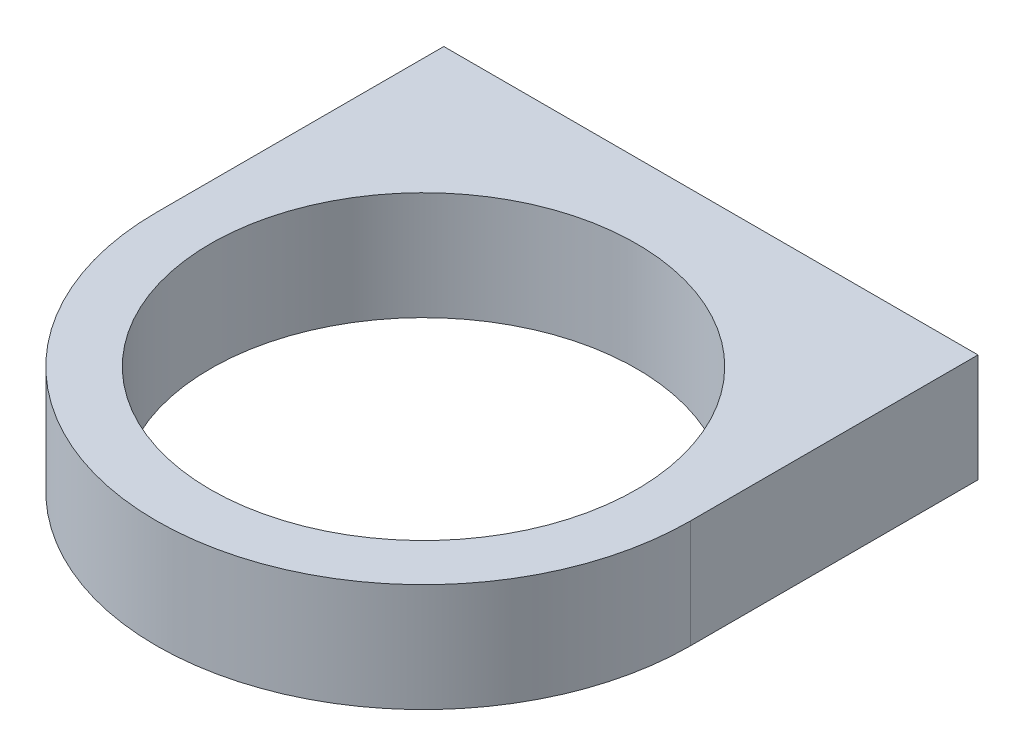
ISO-10303-21;
HEADER;
FILE_DESCRIPTION(('STEP AP214'),'2;1');
FILE_NAME('part.step','',(''),(''),'','','');
FILE_SCHEMA(('AUTOMOTIVE_DESIGN { 1 0 10303 214 1 1 1 1 }'));
ENDSEC;
DATA;
#1=APPLICATION_CONTEXT('core data for automotive mechanical design processes');
#2=APPLICATION_PROTOCOL_DEFINITION('international standard','automotive_design',2000,#1);
#3=PRODUCT_CONTEXT('',#1,'mechanical');
#4=PRODUCT('Part','Part','',(#3));
#5=PRODUCT_RELATED_PRODUCT_CATEGORY('part','',(#4));
#6=PRODUCT_DEFINITION_FORMATION('','',#4);
#7=PRODUCT_DEFINITION_CONTEXT('part definition',#1,'design');
#8=PRODUCT_DEFINITION('design','',#6,#7);
#9=PRODUCT_DEFINITION_SHAPE('','',#8);
#10=(LENGTH_UNIT() NAMED_UNIT(*) SI_UNIT(.MILLI.,.METRE.));
#11=(NAMED_UNIT(*) PLANE_ANGLE_UNIT() SI_UNIT($,.RADIAN.));
#12=(NAMED_UNIT(*) SI_UNIT($,.STERADIAN.) SOLID_ANGLE_UNIT());
#13=UNCERTAINTY_MEASURE_WITH_UNIT(LENGTH_MEASURE(1.E-05),#10,'distance_accuracy_value','');
#14=(GEOMETRIC_REPRESENTATION_CONTEXT(3) GLOBAL_UNCERTAINTY_ASSIGNED_CONTEXT((#13)) GLOBAL_UNIT_ASSIGNED_CONTEXT((#10,
#11,#12)) REPRESENTATION_CONTEXT('',''));
#15=CARTESIAN_POINT('',(0.,0.,0.));
#16=DIRECTION('',(0.,0.,1.));
#17=DIRECTION('',(1.,0.,0.));
#18=AXIS2_PLACEMENT_3D('',#15,#16,#17);
#19=CARTESIAN_POINT('',(0.,0.,0.));
#20=DIRECTION('',(0.,1.,0.));
#21=DIRECTION('',(0.,0.,1.));
#22=AXIS2_PLACEMENT_3D('',#19,#20,#21);
#23=PLANE('',#22);
#24=CARTESIAN_POINT('',(-35.5,0.,-38.5));
#25=DIRECTION('',(0.,1.,0.));
#26=DIRECTION('',(0.,0.,1.));
#27=AXIS2_PLACEMENT_3D('',#24,#25,#26);
#28=CIRCLE('',#27,2.);
#29=CARTESIAN_POINT('',(-35.5,0.,-36.5));
#30=VERTEX_POINT('',#29);
#31=EDGE_CURVE('E42',#30,#30,#28,.F.);
#32=ORIENTED_EDGE('',*,*,#31,.F.);
#33=EDGE_LOOP('',(#32));
#34=FACE_BOUND('',#33,.T.);
#35=CARTESIAN_POINT('',(0.,0.,0.));
#36=DIRECTION('',(0.,1.,0.));
#37=DIRECTION('',(0.,0.,1.));
#38=AXIS2_PLACEMENT_3D('',#35,#36,#37);
#39=CIRCLE('',#38,39.5);
#40=CARTESIAN_POINT('',(-39.5,0.,0.));
#41=VERTEX_POINT('',#40);
#42=CARTESIAN_POINT('',(39.5,0.,0.));
#43=VERTEX_POINT('',#42);
#44=EDGE_CURVE('E102',#41,#43,#39,.T.);
#45=ORIENTED_EDGE('',*,*,#44,.F.);
#46=DIRECTION('',(0.,0.,1.));
#47=VECTOR('',#46,1.);
#48=CARTESIAN_POINT('',(-39.5,0.,0.));
#49=LINE('',#48,#47);
#50=CARTESIAN_POINT('',(-39.5,0.,-42.5));
#51=VERTEX_POINT('',#50);
#52=EDGE_CURVE('E73',#51,#41,#49,.T.);
#53=ORIENTED_EDGE('',*,*,#52,.F.);
#54=DIRECTION('',(-1.,0.,0.));
#55=VECTOR('',#54,1.);
#56=CARTESIAN_POINT('',(-39.5,0.,-42.5));
#57=LINE('',#56,#55);
#58=CARTESIAN_POINT('',(39.5,0.,-42.5));
#59=VERTEX_POINT('',#58);
#60=EDGE_CURVE('E67',#59,#51,#57,.T.);
#61=ORIENTED_EDGE('',*,*,#60,.F.);
#62=DIRECTION('',(0.,0.,-1.));
#63=VECTOR('',#62,1.);
#64=CARTESIAN_POINT('',(39.5,0.,-42.5));
#65=LINE('',#64,#63);
#66=EDGE_CURVE('E92',#43,#59,#65,.T.);
#67=ORIENTED_EDGE('',*,*,#66,.F.);
#68=EDGE_LOOP('',(#45,#53,#61,#67));
#69=FACE_BOUND('',#68,.T.);
#70=CARTESIAN_POINT('',(0.,0.,0.));
#71=DIRECTION('',(0.,1.,0.));
#72=DIRECTION('',(0.,0.,1.));
#73=AXIS2_PLACEMENT_3D('',#70,#71,#72);
#74=CIRCLE('',#73,31.5);
#75=CARTESIAN_POINT('',(0.,0.,31.5));
#76=VERTEX_POINT('',#75);
#77=EDGE_CURVE('E124',#76,#76,#74,.T.);
#78=ORIENTED_EDGE('',*,*,#77,.T.);
#79=EDGE_LOOP('',(#78));
#80=FACE_BOUND('',#79,.T.);
#81=CARTESIAN_POINT('',(35.5,0.,-38.5));
#82=DIRECTION('',(0.,1.,0.));
#83=DIRECTION('',(0.,0.,1.));
#84=AXIS2_PLACEMENT_3D('',#81,#82,#83);
#85=CIRCLE('',#84,2.);
#86=CARTESIAN_POINT('',(35.5,0.,-36.5));
#87=VERTEX_POINT('',#86);
#88=EDGE_CURVE('E11',#87,#87,#85,.F.);
#89=ORIENTED_EDGE('',*,*,#88,.F.);
#90=EDGE_LOOP('',(#89));
#91=FACE_BOUND('',#90,.T.);
#92=ADVANCED_FACE('F33',(#34,#69,#80,#91),#23,.F.);
#93=CARTESIAN_POINT('',(0.,16.,0.));
#94=DIRECTION('',(0.,1.,0.));
#95=DIRECTION('',(0.,0.,1.));
#96=AXIS2_PLACEMENT_3D('',#93,#94,#95);
#97=PLANE('',#96);
#98=CARTESIAN_POINT('',(0.,16.,0.));
#99=DIRECTION('',(0.,1.,0.));
#100=DIRECTION('',(0.,0.,1.));
#101=AXIS2_PLACEMENT_3D('',#98,#99,#100);
#102=CIRCLE('',#101,39.5);
#103=CARTESIAN_POINT('',(-39.5,16.,0.));
#104=VERTEX_POINT('',#103);
#105=CARTESIAN_POINT('',(39.5,16.,0.));
#106=VERTEX_POINT('',#105);
#107=EDGE_CURVE('E87',#104,#106,#102,.T.);
#108=ORIENTED_EDGE('',*,*,#107,.T.);
#109=DIRECTION('',(0.,0.,-1.));
#110=VECTOR('',#109,1.);
#111=CARTESIAN_POINT('',(39.5,16.,-42.5));
#112=LINE('',#111,#110);
#113=CARTESIAN_POINT('',(39.5,16.,-42.5));
#114=VERTEX_POINT('',#113);
#115=EDGE_CURVE('E81',#106,#114,#112,.T.);
#116=ORIENTED_EDGE('',*,*,#115,.T.);
#117=DIRECTION('',(-1.,0.,0.));
#118=VECTOR('',#117,1.);
#119=CARTESIAN_POINT('',(-39.5,16.,-42.5));
#120=LINE('',#119,#118);
#121=CARTESIAN_POINT('',(-39.5,16.,-42.5));
#122=VERTEX_POINT('',#121);
#123=EDGE_CURVE('E85',#114,#122,#120,.T.);
#124=ORIENTED_EDGE('',*,*,#123,.T.);
#125=DIRECTION('',(0.,0.,1.));
#126=VECTOR('',#125,1.);
#127=CARTESIAN_POINT('',(-39.5,16.,0.));
#128=LINE('',#127,#126);
#129=EDGE_CURVE('E50',#122,#104,#128,.T.);
#130=ORIENTED_EDGE('',*,*,#129,.T.);
#131=EDGE_LOOP('',(#108,#116,#124,#130));
#132=FACE_BOUND('',#131,.T.);
#133=CARTESIAN_POINT('',(0.,16.,0.));
#134=DIRECTION('',(0.,1.,0.));
#135=DIRECTION('',(0.,0.,1.));
#136=AXIS2_PLACEMENT_3D('',#133,#134,#135);
#137=CIRCLE('',#136,31.5);
#138=CARTESIAN_POINT('',(0.,16.,31.5));
#139=VERTEX_POINT('',#138);
#140=EDGE_CURVE('E105',#139,#139,#137,.T.);
#141=ORIENTED_EDGE('',*,*,#140,.F.);
#142=EDGE_LOOP('',(#141));
#143=FACE_BOUND('',#142,.T.);
#144=ADVANCED_FACE('F82',(#132,#143),#97,.T.);
#145=CARTESIAN_POINT('',(0.,16.,0.));
#146=DIRECTION('',(0.,-1.,0.));
#147=DIRECTION('',(0.,0.,-1.));
#148=AXIS2_PLACEMENT_3D('',#145,#146,#147);
#149=CYLINDRICAL_SURFACE('',#148,39.5);
#150=ORIENTED_EDGE('',*,*,#44,.T.);
#151=DIRECTION('',(0.,-1.,0.));
#152=VECTOR('',#151,1.);
#153=CARTESIAN_POINT('',(39.5,16.,0.));
#154=LINE('',#153,#152);
#155=EDGE_CURVE('E93',#106,#43,#154,.T.);
#156=ORIENTED_EDGE('',*,*,#155,.F.);
#157=ORIENTED_EDGE('',*,*,#107,.F.);
#158=DIRECTION('',(0.,-1.,0.));
#159=VECTOR('',#158,1.);
#160=CARTESIAN_POINT('',(-39.5,16.,0.));
#161=LINE('',#160,#159);
#162=EDGE_CURVE('E98',#104,#41,#161,.T.);
#163=ORIENTED_EDGE('',*,*,#162,.T.);
#164=EDGE_LOOP('',(#150,#156,#157,#163));
#165=FACE_BOUND('',#164,.T.);
#166=ADVANCED_FACE('F35',(#165),#149,.T.);
#167=CARTESIAN_POINT('',(39.5,16.,-42.5));
#168=DIRECTION('',(-1.,0.,0.));
#169=DIRECTION('',(0.,0.,1.));
#170=AXIS2_PLACEMENT_3D('',#167,#168,#169);
#171=PLANE('',#170);
#172=ORIENTED_EDGE('',*,*,#66,.T.);
#173=DIRECTION('',(0.,-1.,0.));
#174=VECTOR('',#173,1.);
#175=CARTESIAN_POINT('',(39.5,16.,-42.5));
#176=LINE('',#175,#174);
#177=EDGE_CURVE('E90',#114,#59,#176,.T.);
#178=ORIENTED_EDGE('',*,*,#177,.F.);
#179=ORIENTED_EDGE('',*,*,#115,.F.);
#180=ORIENTED_EDGE('',*,*,#155,.T.);
#181=EDGE_LOOP('',(#172,#178,#179,#180));
#182=FACE_BOUND('',#181,.T.);
#183=ADVANCED_FACE('F91',(#182),#171,.F.);
#184=CARTESIAN_POINT('',(-39.5,16.,-42.5));
#185=DIRECTION('',(0.,0.,1.));
#186=DIRECTION('',(1.,0.,0.));
#187=AXIS2_PLACEMENT_3D('',#184,#185,#186);
#188=PLANE('',#187);
#189=ORIENTED_EDGE('',*,*,#60,.T.);
#190=DIRECTION('',(0.,-1.,0.));
#191=VECTOR('',#190,1.);
#192=CARTESIAN_POINT('',(-39.5,16.,-42.5));
#193=LINE('',#192,#191);
#194=EDGE_CURVE('E94',#122,#51,#193,.T.);
#195=ORIENTED_EDGE('',*,*,#194,.F.);
#196=ORIENTED_EDGE('',*,*,#123,.F.);
#197=ORIENTED_EDGE('',*,*,#177,.T.);
#198=EDGE_LOOP('',(#189,#195,#196,#197));
#199=FACE_BOUND('',#198,.T.);
#200=ADVANCED_FACE('F96',(#199),#188,.F.);
#201=CARTESIAN_POINT('',(-39.5,16.,0.));
#202=DIRECTION('',(1.,0.,0.));
#203=DIRECTION('',(0.,0.,-1.));
#204=AXIS2_PLACEMENT_3D('',#201,#202,#203);
#205=PLANE('',#204);
#206=ORIENTED_EDGE('',*,*,#52,.T.);
#207=ORIENTED_EDGE('',*,*,#162,.F.);
#208=ORIENTED_EDGE('',*,*,#129,.F.);
#209=ORIENTED_EDGE('',*,*,#194,.T.);
#210=EDGE_LOOP('',(#206,#207,#208,#209));
#211=FACE_BOUND('',#210,.T.);
#212=ADVANCED_FACE('F149',(#211),#205,.F.);
#213=CARTESIAN_POINT('',(0.,16.,0.));
#214=DIRECTION('',(0.,-1.,0.));
#215=DIRECTION('',(0.,0.,-1.));
#216=AXIS2_PLACEMENT_3D('',#213,#214,#215);
#217=CYLINDRICAL_SURFACE('',#216,31.5);
#218=ORIENTED_EDGE('',*,*,#140,.T.);
#219=EDGE_LOOP('',(#218));
#220=FACE_BOUND('',#219,.T.);
#221=ORIENTED_EDGE('',*,*,#77,.F.);
#222=EDGE_LOOP('',(#221));
#223=FACE_BOUND('',#222,.T.);
#224=ADVANCED_FACE('F145',(#220,#223),#217,.F.);
#225=CARTESIAN_POINT('',(-35.5,-2.,-38.5));
#226=DIRECTION('',(0.,1.,0.));
#227=DIRECTION('',(0.,0.,1.));
#228=AXIS2_PLACEMENT_3D('',#225,#226,#227);
#229=CYLINDRICAL_SURFACE('',#228,2.);
#230=CARTESIAN_POINT('',(-35.5,-2.,-38.5));
#231=DIRECTION('',(0.,-1.,0.));
#232=DIRECTION('',(0.,0.,-1.));
#233=AXIS2_PLACEMENT_3D('',#230,#231,#232);
#234=CIRCLE('',#233,2.);
#235=CARTESIAN_POINT('',(-35.5,-2.,-40.5));
#236=VERTEX_POINT('',#235);
#237=EDGE_CURVE('E165',#236,#236,#234,.T.);
#238=ORIENTED_EDGE('',*,*,#237,.F.);
#239=EDGE_LOOP('',(#238));
#240=FACE_BOUND('',#239,.T.);
#241=ORIENTED_EDGE('',*,*,#31,.T.);
#242=EDGE_LOOP('',(#241));
#243=FACE_BOUND('',#242,.T.);
#244=ADVANCED_FACE('F114',(#240,#243),#229,.T.);
#245=CARTESIAN_POINT('',(-35.5,-2.,-38.5));
#246=DIRECTION('',(0.,-1.,0.));
#247=DIRECTION('',(0.,0.,-1.));
#248=AXIS2_PLACEMENT_3D('',#245,#246,#247);
#249=PLANE('',#248);
#250=ORIENTED_EDGE('',*,*,#237,.T.);
#251=EDGE_LOOP('',(#250));
#252=FACE_BOUND('',#251,.T.);
#253=ADVANCED_FACE('F130',(#252),#249,.T.);
#254=CARTESIAN_POINT('',(35.5,-2.,-38.5));
#255=DIRECTION('',(0.,1.,0.));
#256=DIRECTION('',(0.,0.,1.));
#257=AXIS2_PLACEMENT_3D('',#254,#255,#256);
#258=CYLINDRICAL_SURFACE('',#257,2.);
#259=CARTESIAN_POINT('',(35.5,-2.,-38.5));
#260=DIRECTION('',(0.,-1.,0.));
#261=DIRECTION('',(0.,0.,-1.));
#262=AXIS2_PLACEMENT_3D('',#259,#260,#261);
#263=CIRCLE('',#262,2.);
#264=CARTESIAN_POINT('',(35.5,-2.,-40.5));
#265=VERTEX_POINT('',#264);
#266=EDGE_CURVE('E170',#265,#265,#263,.T.);
#267=ORIENTED_EDGE('',*,*,#266,.F.);
#268=EDGE_LOOP('',(#267));
#269=FACE_BOUND('',#268,.T.);
#270=ORIENTED_EDGE('',*,*,#88,.T.);
#271=EDGE_LOOP('',(#270));
#272=FACE_BOUND('',#271,.T.);
#273=ADVANCED_FACE('F127',(#269,#272),#258,.T.);
#274=CARTESIAN_POINT('',(35.5,-2.,-38.5));
#275=DIRECTION('',(0.,-1.,0.));
#276=DIRECTION('',(0.,0.,-1.));
#277=AXIS2_PLACEMENT_3D('',#274,#275,#276);
#278=PLANE('',#277);
#279=ORIENTED_EDGE('',*,*,#266,.T.);
#280=EDGE_LOOP('',(#279));
#281=FACE_BOUND('',#280,.T.);
#282=ADVANCED_FACE('F129',(#281),#278,.T.);
#283=CLOSED_SHELL('',(#92,#144,#166,#183,#200,#212,#224,#244,#253,#273,#282));
#284=MANIFOLD_SOLID_BREP('B2',#283);
#285=ADVANCED_BREP_SHAPE_REPRESENTATION('',(#18,#284),#14);
#286=SHAPE_DEFINITION_REPRESENTATION(#9,#285);
ENDSEC;
END-ISO-10303-21;
